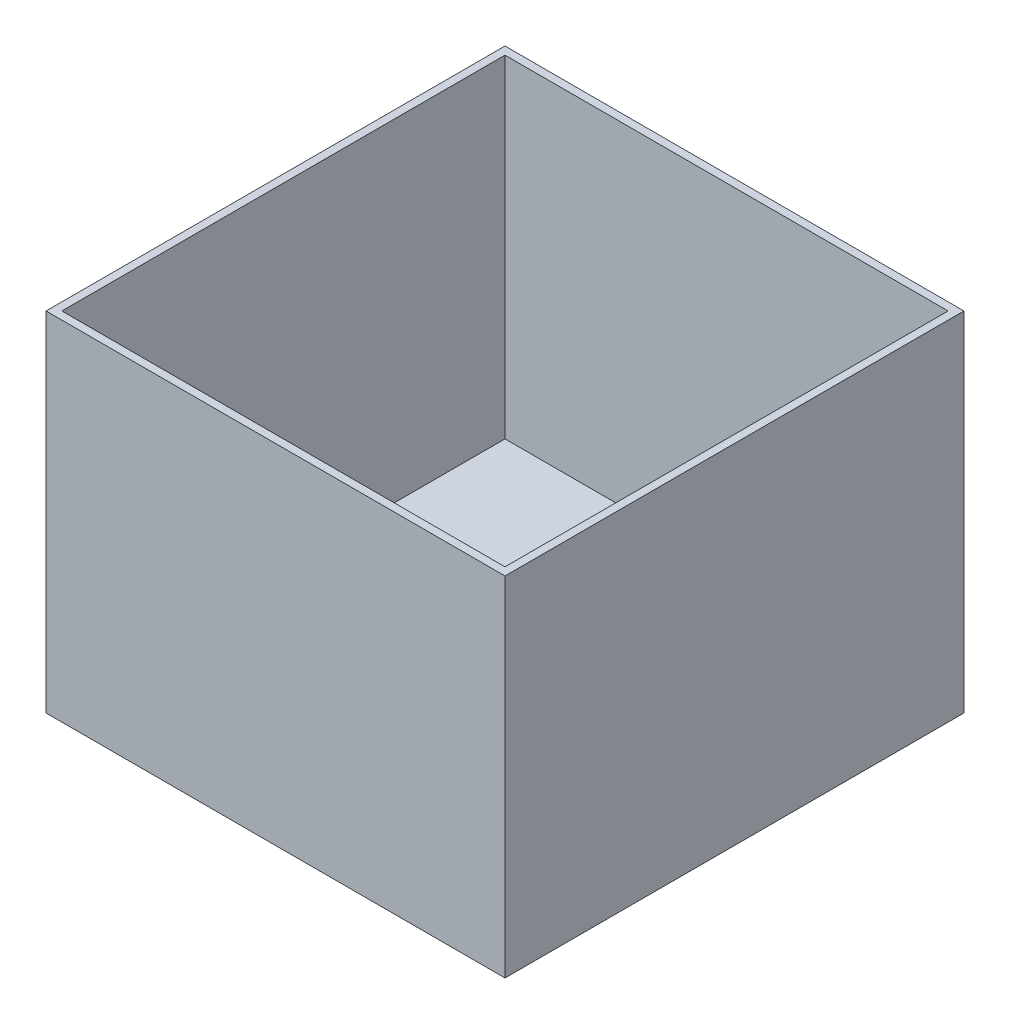
ISO-10303-21;
HEADER;
FILE_DESCRIPTION(('STEP AP214'),'2;1');
FILE_NAME('part.step','',(''),(''),'','','');
FILE_SCHEMA(('AUTOMOTIVE_DESIGN { 1 0 10303 214 1 1 1 1 }'));
ENDSEC;
DATA;
#1=APPLICATION_CONTEXT('core data for automotive mechanical design processes');
#2=APPLICATION_PROTOCOL_DEFINITION('international standard','automotive_design',2000,#1);
#3=PRODUCT_CONTEXT('',#1,'mechanical');
#4=PRODUCT('Part','Part','',(#3));
#5=PRODUCT_RELATED_PRODUCT_CATEGORY('part','',(#4));
#6=PRODUCT_DEFINITION_FORMATION('','',#4);
#7=PRODUCT_DEFINITION_CONTEXT('part definition',#1,'design');
#8=PRODUCT_DEFINITION('design','',#6,#7);
#9=PRODUCT_DEFINITION_SHAPE('','',#8);
#10=(LENGTH_UNIT() NAMED_UNIT(*) SI_UNIT(.MILLI.,.METRE.));
#11=(NAMED_UNIT(*) PLANE_ANGLE_UNIT() SI_UNIT($,.RADIAN.));
#12=(NAMED_UNIT(*) SI_UNIT($,.STERADIAN.) SOLID_ANGLE_UNIT());
#13=UNCERTAINTY_MEASURE_WITH_UNIT(LENGTH_MEASURE(1.E-05),#10,'distance_accuracy_value','');
#14=(GEOMETRIC_REPRESENTATION_CONTEXT(3) GLOBAL_UNCERTAINTY_ASSIGNED_CONTEXT((#13)) GLOBAL_UNIT_ASSIGNED_CONTEXT((#10,
#11,#12)) REPRESENTATION_CONTEXT('',''));
#15=CARTESIAN_POINT('',(0.,0.,0.));
#16=DIRECTION('',(0.,0.,1.));
#17=DIRECTION('',(1.,0.,0.));
#18=AXIS2_PLACEMENT_3D('',#15,#16,#17);
#19=CARTESIAN_POINT('',(0.,6.34999999999999,0.));
#20=DIRECTION('',(0.,1.,0.));
#21=DIRECTION('',(0.,0.,1.));
#22=AXIS2_PLACEMENT_3D('',#19,#20,#21);
#23=PLANE('',#22);
#24=DIRECTION('',(0.,0.,-1.));
#25=VECTOR('',#24,1.);
#26=CARTESIAN_POINT('',(88.9,6.34999999999999,-88.9));
#27=LINE('',#26,#25);
#28=CARTESIAN_POINT('',(88.9,6.34999999999999,88.9));
#29=VERTEX_POINT('',#28);
#30=CARTESIAN_POINT('',(88.9,6.34999999999999,-88.9));
#31=VERTEX_POINT('',#30);
#32=EDGE_CURVE('E109',#29,#31,#27,.T.);
#33=ORIENTED_EDGE('',*,*,#32,.T.);
#34=DIRECTION('',(-1.,0.,0.));
#35=VECTOR('',#34,1.);
#36=CARTESIAN_POINT('',(-88.9,6.34999999999999,-88.9));
#37=LINE('',#36,#35);
#38=CARTESIAN_POINT('',(-88.9,6.34999999999999,-88.9));
#39=VERTEX_POINT('',#38);
#40=EDGE_CURVE('E118',#31,#39,#37,.T.);
#41=ORIENTED_EDGE('',*,*,#40,.T.);
#42=DIRECTION('',(0.,0.,1.));
#43=VECTOR('',#42,1.);
#44=CARTESIAN_POINT('',(-88.9,6.34999999999999,-88.9));
#45=LINE('',#44,#43);
#46=CARTESIAN_POINT('',(-88.9,6.34999999999999,88.9));
#47=VERTEX_POINT('',#46);
#48=EDGE_CURVE('E123',#39,#47,#45,.T.);
#49=ORIENTED_EDGE('',*,*,#48,.T.);
#50=DIRECTION('',(1.,0.,0.));
#51=VECTOR('',#50,1.);
#52=CARTESIAN_POINT('',(-88.9,6.34999999999999,88.9));
#53=LINE('',#52,#51);
#54=EDGE_CURVE('E115',#47,#29,#53,.T.);
#55=ORIENTED_EDGE('',*,*,#54,.T.);
#56=EDGE_LOOP('',(#33,#41,#49,#55));
#57=FACE_BOUND('',#56,.T.);
#58=CARTESIAN_POINT('',(-1.01599999999996,6.34999999999999,-78.6513943740886));
#59=DIRECTION('',(0.,1.,0.));
#60=DIRECTION('',(0.,0.,1.));
#61=AXIS2_PLACEMENT_3D('',#58,#59,#60);
#62=CIRCLE('',#61,5.842);
#63=CARTESIAN_POINT('',(-1.01599999999996,6.34999999999999,-72.8093943740886));
#64=VERTEX_POINT('',#63);
#65=EDGE_CURVE('E133',#64,#64,#62,.T.);
#66=ORIENTED_EDGE('',*,*,#65,.F.);
#67=EDGE_LOOP('',(#66));
#68=FACE_BOUND('',#67,.T.);
#69=ADVANCED_FACE('F33',(#57,#68),#23,.T.);
#70=CARTESIAN_POINT('',(92.075,139.7,92.075));
#71=DIRECTION('',(-1.,0.,0.));
#72=DIRECTION('',(0.,0.,1.));
#73=AXIS2_PLACEMENT_3D('',#70,#71,#72);
#74=PLANE('',#73);
#75=DIRECTION('',(0.,0.,-1.));
#76=VECTOR('',#75,1.);
#77=CARTESIAN_POINT('',(92.075,0.,92.075));
#78=LINE('',#77,#76);
#79=CARTESIAN_POINT('',(92.075,0.,92.075));
#80=VERTEX_POINT('',#79);
#81=CARTESIAN_POINT('',(92.075,0.,-92.075));
#82=VERTEX_POINT('',#81);
#83=EDGE_CURVE('E146',#80,#82,#78,.T.);
#84=ORIENTED_EDGE('',*,*,#83,.T.);
#85=DIRECTION('',(0.,-1.,0.));
#86=VECTOR('',#85,1.);
#87=CARTESIAN_POINT('',(92.075,139.7,-92.075));
#88=LINE('',#87,#86);
#89=CARTESIAN_POINT('',(92.075,139.7,-92.075));
#90=VERTEX_POINT('',#89);
#91=EDGE_CURVE('E11',#90,#82,#88,.T.);
#92=ORIENTED_EDGE('',*,*,#91,.F.);
#93=DIRECTION('',(0.,0.,-1.));
#94=VECTOR('',#93,1.);
#95=CARTESIAN_POINT('',(92.075,139.7,92.075));
#96=LINE('',#95,#94);
#97=CARTESIAN_POINT('',(92.075,139.7,92.075));
#98=VERTEX_POINT('',#97);
#99=EDGE_CURVE('E150',#98,#90,#96,.T.);
#100=ORIENTED_EDGE('',*,*,#99,.F.);
#101=DIRECTION('',(0.,-1.,0.));
#102=VECTOR('',#101,1.);
#103=CARTESIAN_POINT('',(92.075,139.7,92.075));
#104=LINE('',#103,#102);
#105=EDGE_CURVE('E156',#98,#80,#104,.T.);
#106=ORIENTED_EDGE('',*,*,#105,.T.);
#107=EDGE_LOOP('',(#84,#92,#100,#106));
#108=FACE_BOUND('',#107,.T.);
#109=ADVANCED_FACE('F35',(#108),#74,.F.);
#110=CARTESIAN_POINT('',(-92.075,139.7,-92.075));
#111=DIRECTION('',(0.,0.,1.));
#112=DIRECTION('',(1.,0.,0.));
#113=AXIS2_PLACEMENT_3D('',#110,#111,#112);
#114=PLANE('',#113);
#115=DIRECTION('',(-1.,0.,0.));
#116=VECTOR('',#115,1.);
#117=CARTESIAN_POINT('',(-92.075,0.,-92.075));
#118=LINE('',#117,#116);
#119=CARTESIAN_POINT('',(-92.075,0.,-92.075));
#120=VERTEX_POINT('',#119);
#121=EDGE_CURVE('E159',#82,#120,#118,.T.);
#122=ORIENTED_EDGE('',*,*,#121,.T.);
#123=DIRECTION('',(0.,-1.,0.));
#124=VECTOR('',#123,1.);
#125=CARTESIAN_POINT('',(-92.075,139.7,-92.075));
#126=LINE('',#125,#124);
#127=CARTESIAN_POINT('',(-92.075,139.7,-92.075));
#128=VERTEX_POINT('',#127);
#129=EDGE_CURVE('E41',#128,#120,#126,.T.);
#130=ORIENTED_EDGE('',*,*,#129,.F.);
#131=DIRECTION('',(-1.,0.,0.));
#132=VECTOR('',#131,1.);
#133=CARTESIAN_POINT('',(-92.075,139.7,-92.075));
#134=LINE('',#133,#132);
#135=EDGE_CURVE('E85',#90,#128,#134,.T.);
#136=ORIENTED_EDGE('',*,*,#135,.F.);
#137=ORIENTED_EDGE('',*,*,#91,.T.);
#138=EDGE_LOOP('',(#122,#130,#136,#137));
#139=FACE_BOUND('',#138,.T.);
#140=ADVANCED_FACE('F188',(#139),#114,.F.);
#141=CARTESIAN_POINT('',(-92.075,139.7,92.075));
#142=DIRECTION('',(1.,0.,0.));
#143=DIRECTION('',(0.,0.,-1.));
#144=AXIS2_PLACEMENT_3D('',#141,#142,#143);
#145=PLANE('',#144);
#146=DIRECTION('',(0.,0.,1.));
#147=VECTOR('',#146,1.);
#148=CARTESIAN_POINT('',(-92.075,0.,92.075));
#149=LINE('',#148,#147);
#150=CARTESIAN_POINT('',(-92.075,0.,92.075));
#151=VERTEX_POINT('',#150);
#152=EDGE_CURVE('E161',#120,#151,#149,.T.);
#153=ORIENTED_EDGE('',*,*,#152,.T.);
#154=DIRECTION('',(0.,-1.,0.));
#155=VECTOR('',#154,1.);
#156=CARTESIAN_POINT('',(-92.075,139.7,92.075));
#157=LINE('',#156,#155);
#158=CARTESIAN_POINT('',(-92.075,139.7,92.075));
#159=VERTEX_POINT('',#158);
#160=EDGE_CURVE('E165',#159,#151,#157,.T.);
#161=ORIENTED_EDGE('',*,*,#160,.F.);
#162=DIRECTION('',(0.,0.,1.));
#163=VECTOR('',#162,1.);
#164=CARTESIAN_POINT('',(-92.075,139.7,92.075));
#165=LINE('',#164,#163);
#166=EDGE_CURVE('E153',#128,#159,#165,.T.);
#167=ORIENTED_EDGE('',*,*,#166,.F.);
#168=ORIENTED_EDGE('',*,*,#129,.T.);
#169=EDGE_LOOP('',(#153,#161,#167,#168));
#170=FACE_BOUND('',#169,.T.);
#171=ADVANCED_FACE('F170',(#170),#145,.F.);
#172=CARTESIAN_POINT('',(-92.075,139.7,92.075));
#173=DIRECTION('',(0.,0.,-1.));
#174=DIRECTION('',(-1.,0.,0.));
#175=AXIS2_PLACEMENT_3D('',#172,#173,#174);
#176=PLANE('',#175);
#177=DIRECTION('',(1.,0.,0.));
#178=VECTOR('',#177,1.);
#179=CARTESIAN_POINT('',(-92.075,0.,92.075));
#180=LINE('',#179,#178);
#181=EDGE_CURVE('E78',#151,#80,#180,.T.);
#182=ORIENTED_EDGE('',*,*,#181,.T.);
#183=ORIENTED_EDGE('',*,*,#105,.F.);
#184=DIRECTION('',(1.,0.,0.));
#185=VECTOR('',#184,1.);
#186=CARTESIAN_POINT('',(-92.075,139.7,92.075));
#187=LINE('',#186,#185);
#188=EDGE_CURVE('E57',#159,#98,#187,.T.);
#189=ORIENTED_EDGE('',*,*,#188,.F.);
#190=ORIENTED_EDGE('',*,*,#160,.T.);
#191=EDGE_LOOP('',(#182,#183,#189,#190));
#192=FACE_BOUND('',#191,.T.);
#193=ADVANCED_FACE('F178',(#192),#176,.F.);
#194=CARTESIAN_POINT('',(0.,139.7,0.));
#195=DIRECTION('',(0.,-1.,0.));
#196=DIRECTION('',(0.,0.,-1.));
#197=AXIS2_PLACEMENT_3D('',#194,#195,#196);
#198=PLANE('',#197);
#199=DIRECTION('',(-1.,0.,0.));
#200=VECTOR('',#199,1.);
#201=CARTESIAN_POINT('',(-88.9,139.7,-88.9));
#202=LINE('',#201,#200);
#203=CARTESIAN_POINT('',(88.9,139.7,-88.9));
#204=VERTEX_POINT('',#203);
#205=CARTESIAN_POINT('',(-88.9,139.7,-88.9));
#206=VERTEX_POINT('',#205);
#207=EDGE_CURVE('E139',#204,#206,#202,.T.);
#208=ORIENTED_EDGE('',*,*,#207,.F.);
#209=DIRECTION('',(0.,0.,-1.));
#210=VECTOR('',#209,1.);
#211=CARTESIAN_POINT('',(88.9,139.7,-88.9));
#212=LINE('',#211,#210);
#213=CARTESIAN_POINT('',(88.9,139.7,88.9));
#214=VERTEX_POINT('',#213);
#215=EDGE_CURVE('E48',#214,#204,#212,.T.);
#216=ORIENTED_EDGE('',*,*,#215,.F.);
#217=DIRECTION('',(1.,0.,0.));
#218=VECTOR('',#217,1.);
#219=CARTESIAN_POINT('',(-88.9,139.7,88.9));
#220=LINE('',#219,#218);
#221=CARTESIAN_POINT('',(-88.9,139.7,88.9));
#222=VERTEX_POINT('',#221);
#223=EDGE_CURVE('E127',#222,#214,#220,.T.);
#224=ORIENTED_EDGE('',*,*,#223,.F.);
#225=DIRECTION('',(0.,0.,1.));
#226=VECTOR('',#225,1.);
#227=CARTESIAN_POINT('',(-88.9,139.7,-88.9));
#228=LINE('',#227,#226);
#229=EDGE_CURVE('E130',#206,#222,#228,.T.);
#230=ORIENTED_EDGE('',*,*,#229,.F.);
#231=EDGE_LOOP('',(#208,#216,#224,#230));
#232=FACE_BOUND('',#231,.T.);
#233=ORIENTED_EDGE('',*,*,#99,.T.);
#234=ORIENTED_EDGE('',*,*,#135,.T.);
#235=ORIENTED_EDGE('',*,*,#166,.T.);
#236=ORIENTED_EDGE('',*,*,#188,.T.);
#237=EDGE_LOOP('',(#233,#234,#235,#236));
#238=FACE_BOUND('',#237,.T.);
#239=ADVANCED_FACE('F180',(#232,#238),#198,.F.);
#240=CARTESIAN_POINT('',(0.,0.,0.));
#241=DIRECTION('',(0.,-1.,0.));
#242=DIRECTION('',(0.,0.,-1.));
#243=AXIS2_PLACEMENT_3D('',#240,#241,#242);
#244=PLANE('',#243);
#245=ORIENTED_EDGE('',*,*,#83,.F.);
#246=ORIENTED_EDGE('',*,*,#181,.F.);
#247=ORIENTED_EDGE('',*,*,#152,.F.);
#248=ORIENTED_EDGE('',*,*,#121,.F.);
#249=EDGE_LOOP('',(#245,#246,#247,#248));
#250=FACE_BOUND('',#249,.T.);
#251=ADVANCED_FACE('F174',(#250),#244,.T.);
#252=CARTESIAN_POINT('',(88.9,6.34999999999999,-88.9));
#253=DIRECTION('',(1.,0.,0.));
#254=DIRECTION('',(0.,0.,-1.));
#255=AXIS2_PLACEMENT_3D('',#252,#253,#254);
#256=PLANE('',#255);
#257=ORIENTED_EDGE('',*,*,#215,.T.);
#258=DIRECTION('',(0.,1.,0.));
#259=VECTOR('',#258,1.);
#260=CARTESIAN_POINT('',(88.9,6.34999999999999,-88.9));
#261=LINE('',#260,#259);
#262=EDGE_CURVE('E105',#31,#204,#261,.T.);
#263=ORIENTED_EDGE('',*,*,#262,.F.);
#264=ORIENTED_EDGE('',*,*,#32,.F.);
#265=DIRECTION('',(0.,1.,0.));
#266=VECTOR('',#265,1.);
#267=CARTESIAN_POINT('',(88.9,6.34999999999999,88.9));
#268=LINE('',#267,#266);
#269=EDGE_CURVE('E144',#29,#214,#268,.T.);
#270=ORIENTED_EDGE('',*,*,#269,.T.);
#271=EDGE_LOOP('',(#257,#263,#264,#270));
#272=FACE_BOUND('',#271,.T.);
#273=ADVANCED_FACE('F107',(#272),#256,.F.);
#274=CARTESIAN_POINT('',(-88.9,6.34999999999999,88.9));
#275=DIRECTION('',(0.,0.,1.));
#276=DIRECTION('',(1.,0.,0.));
#277=AXIS2_PLACEMENT_3D('',#274,#275,#276);
#278=PLANE('',#277);
#279=ORIENTED_EDGE('',*,*,#223,.T.);
#280=ORIENTED_EDGE('',*,*,#269,.F.);
#281=ORIENTED_EDGE('',*,*,#54,.F.);
#282=DIRECTION('',(0.,1.,0.));
#283=VECTOR('',#282,1.);
#284=CARTESIAN_POINT('',(-88.9,6.34999999999999,88.9));
#285=LINE('',#284,#283);
#286=EDGE_CURVE('E147',#47,#222,#285,.T.);
#287=ORIENTED_EDGE('',*,*,#286,.T.);
#288=EDGE_LOOP('',(#279,#280,#281,#287));
#289=FACE_BOUND('',#288,.T.);
#290=ADVANCED_FACE('F200',(#289),#278,.F.);
#291=CARTESIAN_POINT('',(-88.9,6.34999999999999,-88.9));
#292=DIRECTION('',(-1.,0.,0.));
#293=DIRECTION('',(0.,0.,1.));
#294=AXIS2_PLACEMENT_3D('',#291,#292,#293);
#295=PLANE('',#294);
#296=ORIENTED_EDGE('',*,*,#229,.T.);
#297=ORIENTED_EDGE('',*,*,#286,.F.);
#298=ORIENTED_EDGE('',*,*,#48,.F.);
#299=DIRECTION('',(0.,1.,0.));
#300=VECTOR('',#299,1.);
#301=CARTESIAN_POINT('',(-88.9,6.34999999999999,-88.9));
#302=LINE('',#301,#300);
#303=EDGE_CURVE('E114',#39,#206,#302,.T.);
#304=ORIENTED_EDGE('',*,*,#303,.T.);
#305=EDGE_LOOP('',(#296,#297,#298,#304));
#306=FACE_BOUND('',#305,.T.);
#307=ADVANCED_FACE('F203',(#306),#295,.F.);
#308=CARTESIAN_POINT('',(-88.9,6.34999999999999,-88.9));
#309=DIRECTION('',(0.,0.,-1.));
#310=DIRECTION('',(-1.,0.,0.));
#311=AXIS2_PLACEMENT_3D('',#308,#309,#310);
#312=PLANE('',#311);
#313=ORIENTED_EDGE('',*,*,#207,.T.);
#314=ORIENTED_EDGE('',*,*,#303,.F.);
#315=ORIENTED_EDGE('',*,*,#40,.F.);
#316=ORIENTED_EDGE('',*,*,#262,.T.);
#317=EDGE_LOOP('',(#313,#314,#315,#316));
#318=FACE_BOUND('',#317,.T.);
#319=ADVANCED_FACE('F119',(#318),#312,.F.);
#320=CARTESIAN_POINT('',(-1.01599999999996,12.954,-78.6513943740886));
#321=DIRECTION('',(0.,-1.,0.));
#322=DIRECTION('',(0.,0.,-1.));
#323=AXIS2_PLACEMENT_3D('',#320,#321,#322);
#324=CYLINDRICAL_SURFACE('',#323,5.842);
#325=CARTESIAN_POINT('',(-1.01599999999996,12.954,-78.6513943740886));
#326=DIRECTION('',(0.,1.,0.));
#327=DIRECTION('',(0.,0.,1.));
#328=AXIS2_PLACEMENT_3D('',#325,#326,#327);
#329=CIRCLE('',#328,5.842);
#330=CARTESIAN_POINT('',(-1.01599999999996,12.954,-72.8093943740886));
#331=VERTEX_POINT('',#330);
#332=EDGE_CURVE('E140',#331,#331,#329,.T.);
#333=ORIENTED_EDGE('',*,*,#332,.F.);
#334=EDGE_LOOP('',(#333));
#335=FACE_BOUND('',#334,.T.);
#336=ORIENTED_EDGE('',*,*,#65,.T.);
#337=EDGE_LOOP('',(#336));
#338=FACE_BOUND('',#337,.T.);
#339=ADVANCED_FACE('F198',(#335,#338),#324,.T.);
#340=CARTESIAN_POINT('',(-1.01599999999996,12.954,-78.6513943740886));
#341=DIRECTION('',(0.,1.,0.));
#342=DIRECTION('',(0.,0.,1.));
#343=AXIS2_PLACEMENT_3D('',#340,#341,#342);
#344=PLANE('',#343);
#345=ORIENTED_EDGE('',*,*,#332,.T.);
#346=EDGE_LOOP('',(#345));
#347=FACE_BOUND('',#346,.T.);
#348=ADVANCED_FACE('F238',(#347),#344,.T.);
#349=CLOSED_SHELL('',(#69,#109,#140,#171,#193,#239,#251,#273,#290,#307,#319,#339,#348));
#350=MANIFOLD_SOLID_BREP('B2',#349);
#351=ADVANCED_BREP_SHAPE_REPRESENTATION('',(#18,#350),#14);
#352=SHAPE_DEFINITION_REPRESENTATION(#9,#351);
ENDSEC;
END-ISO-10303-21;
